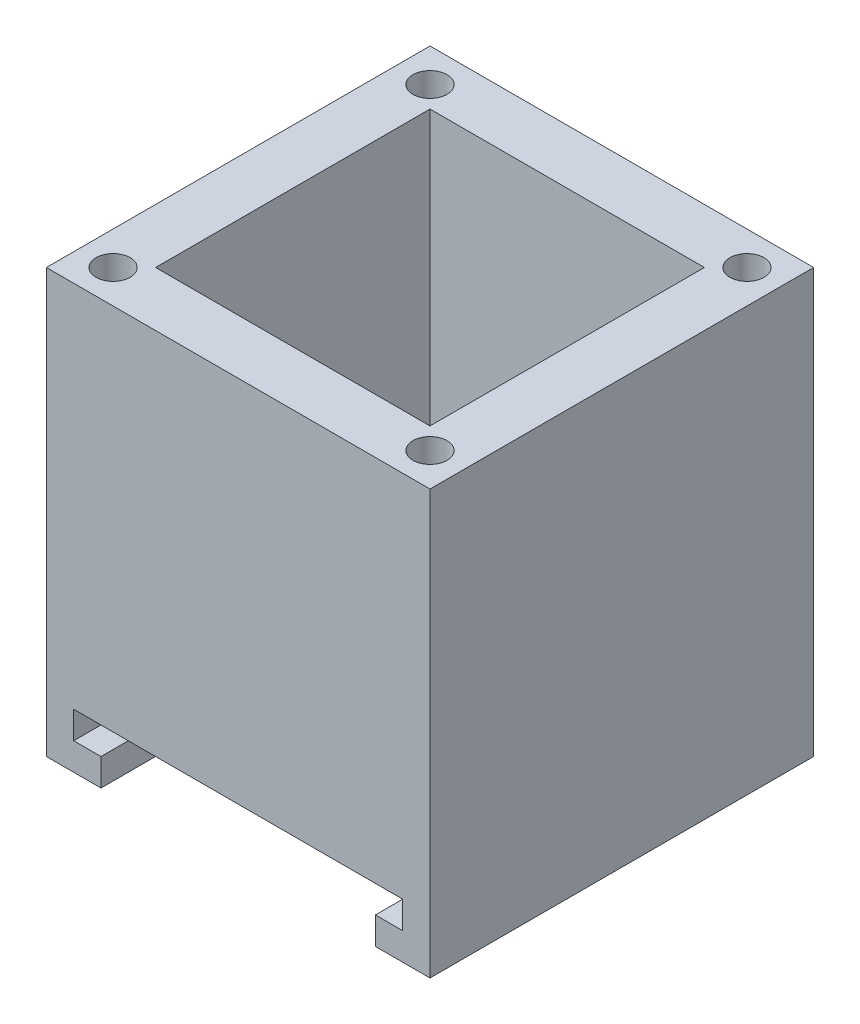
ISO-10303-21;
HEADER;
FILE_DESCRIPTION(('STEP AP214'),'2;1');
FILE_NAME('part.step','',(''),(''),'','','');
FILE_SCHEMA(('AUTOMOTIVE_DESIGN { 1 0 10303 214 1 1 1 1 }'));
ENDSEC;
DATA;
#1=APPLICATION_CONTEXT('core data for automotive mechanical design processes');
#2=APPLICATION_PROTOCOL_DEFINITION('international standard','automotive_design',2000,#1);
#3=PRODUCT_CONTEXT('',#1,'mechanical');
#4=PRODUCT('Part','Part','',(#3));
#5=PRODUCT_RELATED_PRODUCT_CATEGORY('part','',(#4));
#6=PRODUCT_DEFINITION_FORMATION('','',#4);
#7=PRODUCT_DEFINITION_CONTEXT('part definition',#1,'design');
#8=PRODUCT_DEFINITION('design','',#6,#7);
#9=PRODUCT_DEFINITION_SHAPE('','',#8);
#10=(LENGTH_UNIT() NAMED_UNIT(*) SI_UNIT(.MILLI.,.METRE.));
#11=(NAMED_UNIT(*) PLANE_ANGLE_UNIT() SI_UNIT($,.RADIAN.));
#12=(NAMED_UNIT(*) SI_UNIT($,.STERADIAN.) SOLID_ANGLE_UNIT());
#13=UNCERTAINTY_MEASURE_WITH_UNIT(LENGTH_MEASURE(1.E-05),#10,'distance_accuracy_value','');
#14=(GEOMETRIC_REPRESENTATION_CONTEXT(3) GLOBAL_UNCERTAINTY_ASSIGNED_CONTEXT((#13)) GLOBAL_UNIT_ASSIGNED_CONTEXT((#10,
#11,#12)) REPRESENTATION_CONTEXT('',''));
#15=CARTESIAN_POINT('',(0.,0.,0.));
#16=DIRECTION('',(0.,0.,1.));
#17=DIRECTION('',(1.,0.,0.));
#18=AXIS2_PLACEMENT_3D('',#15,#16,#17);
#19=CARTESIAN_POINT('',(-25.527,72.4502310559208,0.));
#20=DIRECTION('',(0.,0.,-1.));
#21=DIRECTION('',(-1.,0.,0.));
#22=AXIS2_PLACEMENT_3D('',#19,#20,#21);
#23=PLANE('',#22);
#24=DIRECTION('',(1.,0.,0.));
#25=VECTOR('',#24,1.);
#26=CARTESIAN_POINT('',(-25.527,10.16,0.));
#27=LINE('',#26,#25);
#28=CARTESIAN_POINT('',(4.191,10.16,0.));
#29=VERTEX_POINT('',#28);
#30=CARTESIAN_POINT('',(25.527,10.16,0.));
#31=VERTEX_POINT('',#30);
#32=EDGE_CURVE('E244',#29,#31,#27,.T.);
#33=ORIENTED_EDGE('',*,*,#32,.F.);
#34=DIRECTION('',(0.,-1.,0.));
#35=VECTOR('',#34,1.);
#36=CARTESIAN_POINT('',(4.191,88.9508,0.));
#37=LINE('',#36,#35);
#38=CARTESIAN_POINT('',(4.191,0.,0.));
#39=VERTEX_POINT('',#38);
#40=EDGE_CURVE('E13',#29,#39,#37,.T.);
#41=ORIENTED_EDGE('',*,*,#40,.T.);
#42=DIRECTION('',(1.,0.,0.));
#43=VECTOR('',#42,1.);
#44=CARTESIAN_POINT('',(-25.527,0.,0.));
#45=LINE('',#44,#43);
#46=CARTESIAN_POINT('',(25.527,0.,0.));
#47=VERTEX_POINT('',#46);
#48=EDGE_CURVE('E355',#39,#47,#45,.T.);
#49=ORIENTED_EDGE('',*,*,#48,.T.);
#50=DIRECTION('',(0.,-1.,0.));
#51=VECTOR('',#50,1.);
#52=CARTESIAN_POINT('',(25.527,72.4502310559208,0.));
#53=LINE('',#52,#51);
#54=CARTESIAN_POINT('',(25.527,5.08,0.));
#55=VERTEX_POINT('',#54);
#56=EDGE_CURVE('E243',#55,#47,#53,.T.);
#57=ORIENTED_EDGE('',*,*,#56,.F.);
#58=DIRECTION('',(-1.,0.,0.));
#59=VECTOR('',#58,1.);
#60=CARTESIAN_POINT('',(71.7337525444387,5.08,0.));
#61=LINE('',#60,#59);
#62=CARTESIAN_POINT('',(30.607,5.08,0.));
#63=VERTEX_POINT('',#62);
#64=EDGE_CURVE('E318',#63,#55,#61,.T.);
#65=ORIENTED_EDGE('',*,*,#64,.F.);
#66=DIRECTION('',(0.,1.,0.));
#67=VECTOR('',#66,1.);
#68=CARTESIAN_POINT('',(30.607,88.9508,0.));
#69=LINE('',#68,#67);
#70=CARTESIAN_POINT('',(30.607,10.16,0.));
#71=VERTEX_POINT('',#70);
#72=EDGE_CURVE('E317',#63,#71,#69,.T.);
#73=ORIENTED_EDGE('',*,*,#72,.T.);
#74=DIRECTION('',(-1.,0.,0.));
#75=VECTOR('',#74,1.);
#76=CARTESIAN_POINT('',(71.7337525444387,10.16,0.));
#77=LINE('',#76,#75);
#78=EDGE_CURVE('E329',#71,#31,#77,.T.);
#79=ORIENTED_EDGE('',*,*,#78,.T.);
#80=EDGE_LOOP('',(#33,#41,#49,#57,#65,#73,#79));
#81=FACE_BOUND('',#80,.T.);
#82=ADVANCED_FACE('F40',(#81),#23,.F.);
#83=CARTESIAN_POINT('',(25.527,88.9508,-35.687));
#84=DIRECTION('',(-1.,0.,0.));
#85=DIRECTION('',(0.,0.,1.));
#86=AXIS2_PLACEMENT_3D('',#83,#84,#85);
#87=PLANE('',#86);
#88=DIRECTION('',(0.,0.,1.));
#89=VECTOR('',#88,1.);
#90=CARTESIAN_POINT('',(25.527,5.08,-35.687));
#91=LINE('',#90,#89);
#92=CARTESIAN_POINT('',(25.527,5.08,35.687));
#93=VERTEX_POINT('',#92);
#94=EDGE_CURVE('E313',#55,#93,#91,.T.);
#95=ORIENTED_EDGE('',*,*,#94,.F.);
#96=ORIENTED_EDGE('',*,*,#56,.T.);
#97=DIRECTION('',(0.,0.,1.));
#98=VECTOR('',#97,1.);
#99=CARTESIAN_POINT('',(25.527,0.,35.687));
#100=LINE('',#99,#98);
#101=CARTESIAN_POINT('',(25.527,0.,35.687));
#102=VERTEX_POINT('',#101);
#103=EDGE_CURVE('E249',#47,#102,#100,.T.);
#104=ORIENTED_EDGE('',*,*,#103,.T.);
#105=DIRECTION('',(0.,-1.,0.));
#106=VECTOR('',#105,1.);
#107=CARTESIAN_POINT('',(25.527,72.4502310559208,35.687));
#108=LINE('',#107,#106);
#109=EDGE_CURVE('E247',#93,#102,#108,.T.);
#110=ORIENTED_EDGE('',*,*,#109,.F.);
#111=EDGE_LOOP('',(#95,#96,#104,#110));
#112=FACE_BOUND('',#111,.T.);
#113=ADVANCED_FACE('F403',(#112),#87,.T.);
#114=CARTESIAN_POINT('',(-25.527,88.9508,-35.687));
#115=DIRECTION('',(1.,0.,0.));
#116=DIRECTION('',(0.,0.,-1.));
#117=AXIS2_PLACEMENT_3D('',#114,#115,#116);
#118=PLANE('',#117);
#119=DIRECTION('',(0.,0.,1.));
#120=VECTOR('',#119,1.);
#121=CARTESIAN_POINT('',(-25.527,10.16,-35.687));
#122=LINE('',#121,#120);
#123=CARTESIAN_POINT('',(-25.527,10.16,0.));
#124=VERTEX_POINT('',#123);
#125=CARTESIAN_POINT('',(-25.527,10.16,25.527));
#126=VERTEX_POINT('',#125);
#127=EDGE_CURVE('E335',#124,#126,#122,.T.);
#128=ORIENTED_EDGE('',*,*,#127,.F.);
#129=DIRECTION('',(0.,0.,1.));
#130=VECTOR('',#129,1.);
#131=CARTESIAN_POINT('',(-25.527,10.16,-35.687));
#132=LINE('',#131,#130);
#133=CARTESIAN_POINT('',(-25.527,10.16,-25.527));
#134=VERTEX_POINT('',#133);
#135=EDGE_CURVE('E219',#134,#124,#132,.T.);
#136=ORIENTED_EDGE('',*,*,#135,.F.);
#137=DIRECTION('',(0.,-1.,0.));
#138=VECTOR('',#137,1.);
#139=CARTESIAN_POINT('',(-25.527,88.9508,-25.527));
#140=LINE('',#139,#138);
#141=CARTESIAN_POINT('',(-25.527,78.7908,-25.527));
#142=VERTEX_POINT('',#141);
#143=EDGE_CURVE('E216',#142,#134,#140,.T.);
#144=ORIENTED_EDGE('',*,*,#143,.F.);
#145=DIRECTION('',(0.,0.,1.));
#146=VECTOR('',#145,1.);
#147=CARTESIAN_POINT('',(-25.527,78.7908,-35.687));
#148=LINE('',#147,#146);
#149=CARTESIAN_POINT('',(-25.527,78.7908,25.527));
#150=VERTEX_POINT('',#149);
#151=EDGE_CURVE('E201',#142,#150,#148,.T.);
#152=ORIENTED_EDGE('',*,*,#151,.T.);
#153=DIRECTION('',(0.,-1.,0.));
#154=VECTOR('',#153,1.);
#155=CARTESIAN_POINT('',(-25.527,88.9508,25.527));
#156=LINE('',#155,#154);
#157=EDGE_CURVE('E210',#150,#126,#156,.T.);
#158=ORIENTED_EDGE('',*,*,#157,.T.);
#159=EDGE_LOOP('',(#128,#136,#144,#152,#158));
#160=FACE_BOUND('',#159,.T.);
#161=ADVANCED_FACE('F380',(#160),#118,.T.);
#162=CARTESIAN_POINT('',(0.,10.16,0.));
#163=DIRECTION('',(0.,1.,0.));
#164=DIRECTION('',(0.,0.,1.));
#165=AXIS2_PLACEMENT_3D('',#162,#163,#164);
#166=PLANE('',#165);
#167=CARTESIAN_POINT('',(0.,10.16,0.));
#168=DIRECTION('',(0.,1.,0.));
#169=DIRECTION('',(0.,0.,1.));
#170=AXIS2_PLACEMENT_3D('',#167,#168,#169);
#171=CIRCLE('',#170,4.191);
#172=CARTESIAN_POINT('',(-4.191,10.16,0.));
#173=VERTEX_POINT('',#172);
#174=EDGE_CURVE('E63',#29,#173,#171,.T.);
#175=ORIENTED_EDGE('',*,*,#174,.F.);
#176=ORIENTED_EDGE('',*,*,#32,.T.);
#177=DIRECTION('',(0.,0.,-1.));
#178=VECTOR('',#177,1.);
#179=CARTESIAN_POINT('',(25.527,10.16,-35.687));
#180=LINE('',#179,#178);
#181=CARTESIAN_POINT('',(25.527,10.16,-25.527));
#182=VERTEX_POINT('',#181);
#183=EDGE_CURVE('E192',#31,#182,#180,.T.);
#184=ORIENTED_EDGE('',*,*,#183,.T.);
#185=DIRECTION('',(-1.,0.,0.));
#186=VECTOR('',#185,1.);
#187=CARTESIAN_POINT('',(-35.687,10.16,-25.527));
#188=LINE('',#187,#186);
#189=EDGE_CURVE('E225',#182,#134,#188,.T.);
#190=ORIENTED_EDGE('',*,*,#189,.T.);
#191=ORIENTED_EDGE('',*,*,#135,.T.);
#192=EDGE_CURVE('E236',#124,#173,#27,.T.);
#193=ORIENTED_EDGE('',*,*,#192,.T.);
#194=EDGE_LOOP('',(#175,#176,#184,#190,#191,#193));
#195=FACE_BOUND('',#194,.T.);
#196=ADVANCED_FACE('F42',(#195),#166,.T.);
#197=CARTESIAN_POINT('',(35.687,88.9508,-35.687));
#198=DIRECTION('',(-1.,0.,0.));
#199=DIRECTION('',(0.,0.,1.));
#200=AXIS2_PLACEMENT_3D('',#197,#198,#199);
#201=PLANE('',#200);
#202=DIRECTION('',(0.,-1.,0.));
#203=VECTOR('',#202,1.);
#204=CARTESIAN_POINT('',(35.687,88.9508,-35.687));
#205=LINE('',#204,#203);
#206=CARTESIAN_POINT('',(35.687,78.7908,-35.687));
#207=VERTEX_POINT('',#206);
#208=CARTESIAN_POINT('',(35.687,0.,-35.687));
#209=VERTEX_POINT('',#208);
#210=EDGE_CURVE('E190',#207,#209,#205,.T.);
#211=ORIENTED_EDGE('',*,*,#210,.F.);
#212=DIRECTION('',(0.,0.,1.));
#213=VECTOR('',#212,1.);
#214=CARTESIAN_POINT('',(35.687,78.7908,-35.687));
#215=LINE('',#214,#213);
#216=CARTESIAN_POINT('',(35.687,78.7908,35.687));
#217=VERTEX_POINT('',#216);
#218=EDGE_CURVE('E172',#207,#217,#215,.T.);
#219=ORIENTED_EDGE('',*,*,#218,.T.);
#220=DIRECTION('',(0.,-1.,0.));
#221=VECTOR('',#220,1.);
#222=CARTESIAN_POINT('',(35.687,88.9508,35.687));
#223=LINE('',#222,#221);
#224=CARTESIAN_POINT('',(35.687,0.,35.687));
#225=VERTEX_POINT('',#224);
#226=EDGE_CURVE('E194',#217,#225,#223,.T.);
#227=ORIENTED_EDGE('',*,*,#226,.T.);
#228=DIRECTION('',(0.,0.,-1.));
#229=VECTOR('',#228,1.);
#230=CARTESIAN_POINT('',(35.687,0.,-35.687));
#231=LINE('',#230,#229);
#232=EDGE_CURVE('E265',#225,#209,#231,.T.);
#233=ORIENTED_EDGE('',*,*,#232,.T.);
#234=EDGE_LOOP('',(#211,#219,#227,#233));
#235=FACE_BOUND('',#234,.T.);
#236=ADVANCED_FACE('F285',(#235),#201,.F.);
#237=CARTESIAN_POINT('',(-35.687,88.9508,-35.687));
#238=DIRECTION('',(0.,0.,1.));
#239=DIRECTION('',(1.,0.,0.));
#240=AXIS2_PLACEMENT_3D('',#237,#238,#239);
#241=PLANE('',#240);
#242=CARTESIAN_POINT('',(-19.0627,19.0627,-35.687));
#243=DIRECTION('',(0.,0.,1.));
#244=DIRECTION('',(1.,0.,0.));
#245=AXIS2_PLACEMENT_3D('',#242,#243,#244);
#246=CIRCLE('',#245,4.064);
#247=CARTESIAN_POINT('',(-14.9987,19.0627,-35.687));
#248=VERTEX_POINT('',#247);
#249=EDGE_CURVE('E266',#248,#248,#246,.F.);
#250=ORIENTED_EDGE('',*,*,#249,.F.);
#251=EDGE_LOOP('',(#250));
#252=FACE_BOUND('',#251,.T.);
#253=CARTESIAN_POINT('',(19.0627,19.0627,-35.687));
#254=DIRECTION('',(0.,0.,1.));
#255=DIRECTION('',(1.,0.,0.));
#256=AXIS2_PLACEMENT_3D('',#253,#254,#255);
#257=CIRCLE('',#256,4.064);
#258=CARTESIAN_POINT('',(23.1267,19.0627,-35.687));
#259=VERTEX_POINT('',#258);
#260=EDGE_CURVE('E261',#259,#259,#257,.F.);
#261=ORIENTED_EDGE('',*,*,#260,.F.);
#262=EDGE_LOOP('',(#261));
#263=FACE_BOUND('',#262,.T.);
#264=DIRECTION('',(0.,-1.,0.));
#265=VECTOR('',#264,1.);
#266=CARTESIAN_POINT('',(-35.687,88.9508,-35.687));
#267=LINE('',#266,#265);
#268=CARTESIAN_POINT('',(-35.687,78.7908,-35.687));
#269=VERTEX_POINT('',#268);
#270=CARTESIAN_POINT('',(-35.687,0.,-35.687));
#271=VERTEX_POINT('',#270);
#272=EDGE_CURVE('E182',#269,#271,#267,.T.);
#273=ORIENTED_EDGE('',*,*,#272,.F.);
#274=DIRECTION('',(1.,0.,0.));
#275=VECTOR('',#274,1.);
#276=CARTESIAN_POINT('',(-35.687,78.7908,-35.687));
#277=LINE('',#276,#275);
#278=EDGE_CURVE('E169',#269,#207,#277,.T.);
#279=ORIENTED_EDGE('',*,*,#278,.T.);
#280=ORIENTED_EDGE('',*,*,#210,.T.);
#281=DIRECTION('',(-1.,0.,0.));
#282=VECTOR('',#281,1.);
#283=CARTESIAN_POINT('',(-35.687,0.,-35.687));
#284=LINE('',#283,#282);
#285=EDGE_CURVE('E188',#209,#271,#284,.T.);
#286=ORIENTED_EDGE('',*,*,#285,.T.);
#287=EDGE_LOOP('',(#273,#279,#280,#286));
#288=FACE_BOUND('',#287,.T.);
#289=ADVANCED_FACE('F186',(#252,#263,#288),#241,.F.);
#290=CARTESIAN_POINT('',(-35.687,88.9508,-35.687));
#291=DIRECTION('',(1.,0.,0.));
#292=DIRECTION('',(0.,0.,-1.));
#293=AXIS2_PLACEMENT_3D('',#290,#291,#292);
#294=PLANE('',#293);
#295=DIRECTION('',(0.,-1.,0.));
#296=VECTOR('',#295,1.);
#297=CARTESIAN_POINT('',(-35.687,88.9508,35.687));
#298=LINE('',#297,#296);
#299=CARTESIAN_POINT('',(-35.687,78.7908,35.687));
#300=VERTEX_POINT('',#299);
#301=CARTESIAN_POINT('',(-35.687,0.,35.687));
#302=VERTEX_POINT('',#301);
#303=EDGE_CURVE('E184',#300,#302,#298,.T.);
#304=ORIENTED_EDGE('',*,*,#303,.F.);
#305=DIRECTION('',(0.,0.,1.));
#306=VECTOR('',#305,1.);
#307=CARTESIAN_POINT('',(-35.687,78.7908,-35.687));
#308=LINE('',#307,#306);
#309=EDGE_CURVE('E55',#269,#300,#308,.T.);
#310=ORIENTED_EDGE('',*,*,#309,.F.);
#311=ORIENTED_EDGE('',*,*,#272,.T.);
#312=DIRECTION('',(0.,0.,1.));
#313=VECTOR('',#312,1.);
#314=CARTESIAN_POINT('',(-35.687,0.,-35.687));
#315=LINE('',#314,#313);
#316=EDGE_CURVE('E277',#271,#302,#315,.T.);
#317=ORIENTED_EDGE('',*,*,#316,.T.);
#318=EDGE_LOOP('',(#304,#310,#311,#317));
#319=FACE_BOUND('',#318,.T.);
#320=ADVANCED_FACE('F180',(#319),#294,.F.);
#321=CARTESIAN_POINT('',(-35.687,88.9508,35.687));
#322=DIRECTION('',(0.,0.,-1.));
#323=DIRECTION('',(-1.,0.,0.));
#324=AXIS2_PLACEMENT_3D('',#321,#322,#323);
#325=PLANE('',#324);
#326=ORIENTED_EDGE('',*,*,#226,.F.);
#327=DIRECTION('',(1.,0.,0.));
#328=VECTOR('',#327,1.);
#329=CARTESIAN_POINT('',(-35.687,78.7908,35.687));
#330=LINE('',#329,#328);
#331=EDGE_CURVE('E176',#300,#217,#330,.T.);
#332=ORIENTED_EDGE('',*,*,#331,.F.);
#333=ORIENTED_EDGE('',*,*,#303,.T.);
#334=DIRECTION('',(1.,0.,0.));
#335=VECTOR('',#334,1.);
#336=CARTESIAN_POINT('',(-35.687,0.,35.687));
#337=LINE('',#336,#335);
#338=CARTESIAN_POINT('',(-25.527,0.,35.687));
#339=VERTEX_POINT('',#338);
#340=EDGE_CURVE('E280',#302,#339,#337,.T.);
#341=ORIENTED_EDGE('',*,*,#340,.T.);
#342=DIRECTION('',(0.,-1.,0.));
#343=VECTOR('',#342,1.);
#344=CARTESIAN_POINT('',(-25.527,72.4502310559208,35.687));
#345=LINE('',#344,#343);
#346=CARTESIAN_POINT('',(-25.527,5.08,35.687));
#347=VERTEX_POINT('',#346);
#348=EDGE_CURVE('E256',#347,#339,#345,.T.);
#349=ORIENTED_EDGE('',*,*,#348,.F.);
#350=DIRECTION('',(1.,0.,0.));
#351=VECTOR('',#350,1.);
#352=CARTESIAN_POINT('',(-71.7337525444387,5.08,35.687));
#353=LINE('',#352,#351);
#354=CARTESIAN_POINT('',(-30.607,5.08,35.687));
#355=VERTEX_POINT('',#354);
#356=EDGE_CURVE('E347',#355,#347,#353,.T.);
#357=ORIENTED_EDGE('',*,*,#356,.F.);
#358=DIRECTION('',(0.,1.,0.));
#359=VECTOR('',#358,1.);
#360=CARTESIAN_POINT('',(-30.607,88.9508,35.687));
#361=LINE('',#360,#359);
#362=CARTESIAN_POINT('',(-30.607,10.16,35.687));
#363=VERTEX_POINT('',#362);
#364=EDGE_CURVE('E343',#355,#363,#361,.T.);
#365=ORIENTED_EDGE('',*,*,#364,.T.);
#366=DIRECTION('',(-1.,0.,0.));
#367=VECTOR('',#366,1.);
#368=CARTESIAN_POINT('',(-25.527,10.16,35.687));
#369=LINE('',#368,#367);
#370=CARTESIAN_POINT('',(30.607,10.16,35.687));
#371=VERTEX_POINT('',#370);
#372=EDGE_CURVE('E254',#371,#363,#369,.T.);
#373=ORIENTED_EDGE('',*,*,#372,.F.);
#374=DIRECTION('',(0.,-1.,0.));
#375=VECTOR('',#374,1.);
#376=CARTESIAN_POINT('',(30.607,88.9508,35.687));
#377=LINE('',#376,#375);
#378=CARTESIAN_POINT('',(30.607,5.08,35.687));
#379=VERTEX_POINT('',#378);
#380=EDGE_CURVE('E322',#371,#379,#377,.T.);
#381=ORIENTED_EDGE('',*,*,#380,.T.);
#382=DIRECTION('',(-1.,0.,0.));
#383=VECTOR('',#382,1.);
#384=CARTESIAN_POINT('',(71.7337525444387,5.08,35.687));
#385=LINE('',#384,#383);
#386=EDGE_CURVE('E327',#379,#93,#385,.T.);
#387=ORIENTED_EDGE('',*,*,#386,.T.);
#388=ORIENTED_EDGE('',*,*,#109,.T.);
#389=EDGE_CURVE('E279',#102,#225,#337,.T.);
#390=ORIENTED_EDGE('',*,*,#389,.T.);
#391=EDGE_LOOP('',(#326,#332,#333,#341,#349,#357,#365,#373,#381,#387,#388,#390));
#392=FACE_BOUND('',#391,.T.);
#393=ADVANCED_FACE('F289',(#392),#325,.F.);
#394=CARTESIAN_POINT('',(0.,0.,0.));
#395=DIRECTION('',(0.,1.,0.));
#396=DIRECTION('',(0.,0.,1.));
#397=AXIS2_PLACEMENT_3D('',#394,#395,#396);
#398=PLANE('',#397);
#399=ORIENTED_EDGE('',*,*,#48,.F.);
#400=CARTESIAN_POINT('',(0.,0.,0.));
#401=DIRECTION('',(0.,-1.,0.));
#402=DIRECTION('',(0.,0.,-1.));
#403=AXIS2_PLACEMENT_3D('',#400,#401,#402);
#404=CIRCLE('',#403,4.191);
#405=CARTESIAN_POINT('',(-4.191,0.,0.));
#406=VERTEX_POINT('',#405);
#407=EDGE_CURVE('E309',#406,#39,#404,.T.);
#408=ORIENTED_EDGE('',*,*,#407,.F.);
#409=CARTESIAN_POINT('',(-25.527,0.,0.));
#410=VERTEX_POINT('',#409);
#411=EDGE_CURVE('E238',#410,#406,#45,.T.);
#412=ORIENTED_EDGE('',*,*,#411,.F.);
#413=DIRECTION('',(0.,0.,-1.));
#414=VECTOR('',#413,1.);
#415=CARTESIAN_POINT('',(-25.527,0.,35.687));
#416=LINE('',#415,#414);
#417=EDGE_CURVE('E252',#339,#410,#416,.T.);
#418=ORIENTED_EDGE('',*,*,#417,.F.);
#419=ORIENTED_EDGE('',*,*,#340,.F.);
#420=ORIENTED_EDGE('',*,*,#316,.F.);
#421=ORIENTED_EDGE('',*,*,#285,.F.);
#422=ORIENTED_EDGE('',*,*,#232,.F.);
#423=ORIENTED_EDGE('',*,*,#389,.F.);
#424=ORIENTED_EDGE('',*,*,#103,.F.);
#425=EDGE_LOOP('',(#399,#408,#412,#418,#419,#420,#421,#422,#423,#424));
#426=FACE_BOUND('',#425,.T.);
#427=ADVANCED_FACE('F296',(#426),#398,.F.);
#428=DIRECTION('',(0.,0.,-1.));
#429=VECTOR('',#428,1.);
#430=CARTESIAN_POINT('',(25.527,10.16,-35.687));
#431=LINE('',#430,#429);
#432=CARTESIAN_POINT('',(25.527,10.16,25.527));
#433=VERTEX_POINT('',#432);
#434=EDGE_CURVE('E324',#433,#31,#431,.T.);
#435=ORIENTED_EDGE('',*,*,#434,.F.);
#436=DIRECTION('',(0.,-1.,0.));
#437=VECTOR('',#436,1.);
#438=CARTESIAN_POINT('',(25.527,88.9508,25.527));
#439=LINE('',#438,#437);
#440=CARTESIAN_POINT('',(25.527,78.7908,25.527));
#441=VERTEX_POINT('',#440);
#442=EDGE_CURVE('E227',#441,#433,#439,.T.);
#443=ORIENTED_EDGE('',*,*,#442,.F.);
#444=DIRECTION('',(0.,0.,-1.));
#445=VECTOR('',#444,1.);
#446=CARTESIAN_POINT('',(25.527,78.7908,-35.687));
#447=LINE('',#446,#445);
#448=CARTESIAN_POINT('',(25.527,78.7908,-25.527));
#449=VERTEX_POINT('',#448);
#450=EDGE_CURVE('E207',#441,#449,#447,.T.);
#451=ORIENTED_EDGE('',*,*,#450,.T.);
#452=DIRECTION('',(0.,-1.,0.));
#453=VECTOR('',#452,1.);
#454=CARTESIAN_POINT('',(25.527,88.9508,-25.527));
#455=LINE('',#454,#453);
#456=EDGE_CURVE('E222',#449,#182,#455,.T.);
#457=ORIENTED_EDGE('',*,*,#456,.T.);
#458=ORIENTED_EDGE('',*,*,#183,.F.);
#459=EDGE_LOOP('',(#435,#443,#451,#457,#458));
#460=FACE_BOUND('',#459,.T.);
#461=ADVANCED_FACE('F371',(#460),#87,.T.);
#462=CARTESIAN_POINT('',(-35.687,88.9508,-25.527));
#463=DIRECTION('',(0.,0.,1.));
#464=DIRECTION('',(1.,0.,0.));
#465=AXIS2_PLACEMENT_3D('',#462,#463,#464);
#466=PLANE('',#465);
#467=CARTESIAN_POINT('',(-19.0627,19.0627,-25.527));
#468=DIRECTION('',(0.,0.,1.));
#469=DIRECTION('',(1.,0.,0.));
#470=AXIS2_PLACEMENT_3D('',#467,#468,#469);
#471=CIRCLE('',#470,4.064);
#472=CARTESIAN_POINT('',(-14.9987,19.0627,-25.527));
#473=VERTEX_POINT('',#472);
#474=EDGE_CURVE('E262',#473,#473,#471,.T.);
#475=ORIENTED_EDGE('',*,*,#474,.F.);
#476=EDGE_LOOP('',(#475));
#477=FACE_BOUND('',#476,.T.);
#478=CARTESIAN_POINT('',(19.0627,19.0627,-25.527));
#479=DIRECTION('',(0.,0.,1.));
#480=DIRECTION('',(1.,0.,0.));
#481=AXIS2_PLACEMENT_3D('',#478,#479,#480);
#482=CIRCLE('',#481,4.064);
#483=CARTESIAN_POINT('',(23.1267,19.0627,-25.527));
#484=VERTEX_POINT('',#483);
#485=EDGE_CURVE('E269',#484,#484,#482,.T.);
#486=ORIENTED_EDGE('',*,*,#485,.F.);
#487=EDGE_LOOP('',(#486));
#488=FACE_BOUND('',#487,.T.);
#489=ORIENTED_EDGE('',*,*,#189,.F.);
#490=ORIENTED_EDGE('',*,*,#456,.F.);
#491=DIRECTION('',(-1.,0.,0.));
#492=VECTOR('',#491,1.);
#493=CARTESIAN_POINT('',(-35.687,78.7908,-25.527));
#494=LINE('',#493,#492);
#495=EDGE_CURVE('E204',#449,#142,#494,.T.);
#496=ORIENTED_EDGE('',*,*,#495,.T.);
#497=ORIENTED_EDGE('',*,*,#143,.T.);
#498=EDGE_LOOP('',(#489,#490,#496,#497));
#499=FACE_BOUND('',#498,.T.);
#500=ADVANCED_FACE('F369',(#477,#488,#499),#466,.T.);
#501=DIRECTION('',(0.,0.,-1.));
#502=VECTOR('',#501,1.);
#503=CARTESIAN_POINT('',(-25.527,5.08,-35.687));
#504=LINE('',#503,#502);
#505=CARTESIAN_POINT('',(-25.527,5.08000000000003,0.));
#506=VERTEX_POINT('',#505);
#507=EDGE_CURVE('E345',#347,#506,#504,.T.);
#508=ORIENTED_EDGE('',*,*,#507,.F.);
#509=ORIENTED_EDGE('',*,*,#348,.T.);
#510=ORIENTED_EDGE('',*,*,#417,.T.);
#511=DIRECTION('',(0.,-1.,0.));
#512=VECTOR('',#511,1.);
#513=CARTESIAN_POINT('',(-25.527,72.4502310559208,0.));
#514=LINE('',#513,#512);
#515=EDGE_CURVE('E258',#506,#410,#514,.T.);
#516=ORIENTED_EDGE('',*,*,#515,.F.);
#517=EDGE_LOOP('',(#508,#509,#510,#516));
#518=FACE_BOUND('',#517,.T.);
#519=ADVANCED_FACE('F361',(#518),#118,.T.);
#520=CARTESIAN_POINT('',(-35.687,88.9508,25.527));
#521=DIRECTION('',(0.,0.,-1.));
#522=DIRECTION('',(-1.,0.,0.));
#523=AXIS2_PLACEMENT_3D('',#520,#521,#522);
#524=PLANE('',#523);
#525=DIRECTION('',(1.,0.,0.));
#526=VECTOR('',#525,1.);
#527=CARTESIAN_POINT('',(-35.687,10.16,25.527));
#528=LINE('',#527,#526);
#529=EDGE_CURVE('E213',#126,#433,#528,.T.);
#530=ORIENTED_EDGE('',*,*,#529,.F.);
#531=ORIENTED_EDGE('',*,*,#157,.F.);
#532=DIRECTION('',(1.,0.,0.));
#533=VECTOR('',#532,1.);
#534=CARTESIAN_POINT('',(-35.687,78.7908,25.527));
#535=LINE('',#534,#533);
#536=EDGE_CURVE('E198',#150,#441,#535,.T.);
#537=ORIENTED_EDGE('',*,*,#536,.T.);
#538=ORIENTED_EDGE('',*,*,#442,.T.);
#539=EDGE_LOOP('',(#530,#531,#537,#538));
#540=FACE_BOUND('',#539,.T.);
#541=ADVANCED_FACE('F377',(#540),#524,.T.);
#542=CARTESIAN_POINT('',(19.0627,19.0627,-35.689));
#543=DIRECTION('',(0.,0.,1.));
#544=DIRECTION('',(1.,0.,0.));
#545=AXIS2_PLACEMENT_3D('',#542,#543,#544);
#546=CYLINDRICAL_SURFACE('',#545,4.064);
#547=ORIENTED_EDGE('',*,*,#260,.T.);
#548=EDGE_LOOP('',(#547));
#549=FACE_BOUND('',#548,.T.);
#550=ORIENTED_EDGE('',*,*,#485,.T.);
#551=EDGE_LOOP('',(#550));
#552=FACE_BOUND('',#551,.T.);
#553=ADVANCED_FACE('F426',(#549,#552),#546,.F.);
#554=CARTESIAN_POINT('',(-19.0627,19.0627,-35.689));
#555=DIRECTION('',(0.,0.,1.));
#556=DIRECTION('',(1.,0.,0.));
#557=AXIS2_PLACEMENT_3D('',#554,#555,#556);
#558=CYLINDRICAL_SURFACE('',#557,4.064);
#559=ORIENTED_EDGE('',*,*,#249,.T.);
#560=EDGE_LOOP('',(#559));
#561=FACE_BOUND('',#560,.T.);
#562=ORIENTED_EDGE('',*,*,#474,.T.);
#563=EDGE_LOOP('',(#562));
#564=FACE_BOUND('',#563,.T.);
#565=ADVANCED_FACE('F603',(#561,#564),#558,.F.);
#566=CARTESIAN_POINT('',(0.,10.16,0.));
#567=DIRECTION('',(0.,1.,0.));
#568=DIRECTION('',(0.,0.,1.));
#569=AXIS2_PLACEMENT_3D('',#566,#567,#568);
#570=PLANE('',#569);
#571=ORIENTED_EDGE('',*,*,#529,.T.);
#572=ORIENTED_EDGE('',*,*,#434,.T.);
#573=ORIENTED_EDGE('',*,*,#78,.F.);
#574=DIRECTION('',(0.,0.,1.));
#575=VECTOR('',#574,1.);
#576=CARTESIAN_POINT('',(30.607,10.16,-35.687));
#577=LINE('',#576,#575);
#578=EDGE_CURVE('E314',#71,#371,#577,.T.);
#579=ORIENTED_EDGE('',*,*,#578,.T.);
#580=ORIENTED_EDGE('',*,*,#372,.T.);
#581=DIRECTION('',(0.,0.,-1.));
#582=VECTOR('',#581,1.);
#583=CARTESIAN_POINT('',(-30.607,10.16,-35.687));
#584=LINE('',#583,#582);
#585=CARTESIAN_POINT('',(-30.607,10.16,0.));
#586=VERTEX_POINT('',#585);
#587=EDGE_CURVE('E341',#363,#586,#584,.T.);
#588=ORIENTED_EDGE('',*,*,#587,.T.);
#589=DIRECTION('',(1.,0.,0.));
#590=VECTOR('',#589,1.);
#591=CARTESIAN_POINT('',(-71.7337525444387,10.16,0.));
#592=LINE('',#591,#590);
#593=EDGE_CURVE('E339',#586,#124,#592,.T.);
#594=ORIENTED_EDGE('',*,*,#593,.T.);
#595=ORIENTED_EDGE('',*,*,#127,.T.);
#596=EDGE_LOOP('',(#571,#572,#573,#579,#580,#588,#594,#595));
#597=FACE_BOUND('',#596,.T.);
#598=ADVANCED_FACE('F382',(#597),#570,.F.);
#599=ORIENTED_EDGE('',*,*,#411,.T.);
#600=DIRECTION('',(0.,-1.,0.));
#601=VECTOR('',#600,1.);
#602=CARTESIAN_POINT('',(-4.191,88.9508,0.));
#603=LINE('',#602,#601);
#604=EDGE_CURVE('E48',#406,#173,#603,.F.);
#605=ORIENTED_EDGE('',*,*,#604,.T.);
#606=ORIENTED_EDGE('',*,*,#192,.F.);
#607=ORIENTED_EDGE('',*,*,#593,.F.);
#608=DIRECTION('',(0.,-1.,0.));
#609=VECTOR('',#608,1.);
#610=CARTESIAN_POINT('',(-30.607,88.9508,0.));
#611=LINE('',#610,#609);
#612=CARTESIAN_POINT('',(-30.607,5.08,0.));
#613=VERTEX_POINT('',#612);
#614=EDGE_CURVE('E338',#586,#613,#611,.T.);
#615=ORIENTED_EDGE('',*,*,#614,.T.);
#616=DIRECTION('',(1.,0.,0.));
#617=VECTOR('',#616,1.);
#618=CARTESIAN_POINT('',(-71.7337525444387,5.08,0.));
#619=LINE('',#618,#617);
#620=EDGE_CURVE('E349',#613,#506,#619,.T.);
#621=ORIENTED_EDGE('',*,*,#620,.T.);
#622=ORIENTED_EDGE('',*,*,#515,.T.);
#623=EDGE_LOOP('',(#599,#605,#606,#607,#615,#621,#622));
#624=FACE_BOUND('',#623,.T.);
#625=ADVANCED_FACE('F234',(#624),#23,.F.);
#626=CARTESIAN_POINT('',(-71.7337525444387,5.08,-35.687));
#627=DIRECTION('',(0.,-1.,0.));
#628=DIRECTION('',(0.,0.,-1.));
#629=AXIS2_PLACEMENT_3D('',#626,#627,#628);
#630=PLANE('',#629);
#631=DIRECTION('',(0.,0.,1.));
#632=VECTOR('',#631,1.);
#633=CARTESIAN_POINT('',(-30.607,5.08,-35.687));
#634=LINE('',#633,#632);
#635=EDGE_CURVE('E336',#613,#355,#634,.T.);
#636=ORIENTED_EDGE('',*,*,#635,.T.);
#637=ORIENTED_EDGE('',*,*,#356,.T.);
#638=ORIENTED_EDGE('',*,*,#507,.T.);
#639=ORIENTED_EDGE('',*,*,#620,.F.);
#640=EDGE_LOOP('',(#636,#637,#638,#639));
#641=FACE_BOUND('',#640,.T.);
#642=ADVANCED_FACE('F391',(#641),#630,.F.);
#643=CARTESIAN_POINT('',(-30.607,88.9508,-35.687));
#644=DIRECTION('',(1.,0.,0.));
#645=DIRECTION('',(0.,0.,-1.));
#646=AXIS2_PLACEMENT_3D('',#643,#644,#645);
#647=PLANE('',#646);
#648=ORIENTED_EDGE('',*,*,#587,.F.);
#649=ORIENTED_EDGE('',*,*,#364,.F.);
#650=ORIENTED_EDGE('',*,*,#635,.F.);
#651=ORIENTED_EDGE('',*,*,#614,.F.);
#652=EDGE_LOOP('',(#648,#649,#650,#651));
#653=FACE_BOUND('',#652,.T.);
#654=ADVANCED_FACE('F389',(#653),#647,.T.);
#655=CARTESIAN_POINT('',(71.7337525444387,5.08,-35.687));
#656=DIRECTION('',(0.,-1.,0.));
#657=DIRECTION('',(0.,0.,-1.));
#658=AXIS2_PLACEMENT_3D('',#655,#656,#657);
#659=PLANE('',#658);
#660=DIRECTION('',(0.,0.,-1.));
#661=VECTOR('',#660,1.);
#662=CARTESIAN_POINT('',(30.607,5.08,-35.687));
#663=LINE('',#662,#661);
#664=EDGE_CURVE('E320',#379,#63,#663,.T.);
#665=ORIENTED_EDGE('',*,*,#664,.T.);
#666=ORIENTED_EDGE('',*,*,#64,.T.);
#667=ORIENTED_EDGE('',*,*,#94,.T.);
#668=ORIENTED_EDGE('',*,*,#386,.F.);
#669=EDGE_LOOP('',(#665,#666,#667,#668));
#670=FACE_BOUND('',#669,.T.);
#671=ADVANCED_FACE('F400',(#670),#659,.F.);
#672=CARTESIAN_POINT('',(30.607,88.9508,-35.687));
#673=DIRECTION('',(-1.,0.,0.));
#674=DIRECTION('',(0.,0.,1.));
#675=AXIS2_PLACEMENT_3D('',#672,#673,#674);
#676=PLANE('',#675);
#677=ORIENTED_EDGE('',*,*,#664,.F.);
#678=ORIENTED_EDGE('',*,*,#380,.F.);
#679=ORIENTED_EDGE('',*,*,#578,.F.);
#680=ORIENTED_EDGE('',*,*,#72,.F.);
#681=EDGE_LOOP('',(#677,#678,#679,#680));
#682=FACE_BOUND('',#681,.T.);
#683=ADVANCED_FACE('F396',(#682),#676,.T.);
#684=CARTESIAN_POINT('',(0.,88.9508,0.));
#685=DIRECTION('',(0.,-1.,0.));
#686=DIRECTION('',(0.,0.,-1.));
#687=AXIS2_PLACEMENT_3D('',#684,#685,#686);
#688=CYLINDRICAL_SURFACE('',#687,4.191);
#689=ORIENTED_EDGE('',*,*,#174,.T.);
#690=ORIENTED_EDGE('',*,*,#604,.F.);
#691=ORIENTED_EDGE('',*,*,#407,.T.);
#692=ORIENTED_EDGE('',*,*,#40,.F.);
#693=EDGE_LOOP('',(#689,#690,#691,#692));
#694=FACE_BOUND('',#693,.T.);
#695=ADVANCED_FACE('F362',(#694),#688,.F.);
#696=CARTESIAN_POINT('',(-35.687,78.7908,-35.687));
#697=DIRECTION('',(0.,-1.,0.));
#698=DIRECTION('',(0.,0.,-1.));
#699=AXIS2_PLACEMENT_3D('',#696,#697,#698);
#700=PLANE('',#699);
#701=CARTESIAN_POINT('',(29.4847950216924,78.7908,29.4847950216924));
#702=DIRECTION('',(0.,1.,0.));
#703=DIRECTION('',(0.,0.,1.));
#704=AXIS2_PLACEMENT_3D('',#701,#702,#703);
#705=CIRCLE('',#704,3.175);
#706=CARTESIAN_POINT('',(29.4847950216924,78.7908,32.6597950216924));
#707=VERTEX_POINT('',#706);
#708=EDGE_CURVE('E712',#707,#707,#705,.T.);
#709=ORIENTED_EDGE('',*,*,#708,.F.);
#710=EDGE_LOOP('',(#709));
#711=FACE_BOUND('',#710,.T.);
#712=CARTESIAN_POINT('',(-29.4825135870935,78.7908,-29.4825135870935));
#713=DIRECTION('',(0.,1.,0.));
#714=DIRECTION('',(0.,0.,1.));
#715=AXIS2_PLACEMENT_3D('',#712,#713,#714);
#716=CIRCLE('',#715,3.175);
#717=CARTESIAN_POINT('',(-29.4825135870935,78.7908,-26.3075135870935));
#718=VERTEX_POINT('',#717);
#719=EDGE_CURVE('E711',#718,#718,#716,.T.);
#720=ORIENTED_EDGE('',*,*,#719,.F.);
#721=EDGE_LOOP('',(#720));
#722=FACE_BOUND('',#721,.T.);
#723=CARTESIAN_POINT('',(29.4847950216924,78.7908,-29.4847950216924));
#724=DIRECTION('',(0.,1.,0.));
#725=DIRECTION('',(0.,0.,1.));
#726=AXIS2_PLACEMENT_3D('',#723,#724,#725);
#727=CIRCLE('',#726,3.175);
#728=CARTESIAN_POINT('',(29.4847950216924,78.7908,-26.3097950216924));
#729=VERTEX_POINT('',#728);
#730=EDGE_CURVE('E725',#729,#729,#727,.T.);
#731=ORIENTED_EDGE('',*,*,#730,.F.);
#732=EDGE_LOOP('',(#731));
#733=FACE_BOUND('',#732,.T.);
#734=CARTESIAN_POINT('',(-29.4812110895342,78.7908,29.4812110895342));
#735=DIRECTION('',(0.,1.,0.));
#736=DIRECTION('',(0.,0.,1.));
#737=AXIS2_PLACEMENT_3D('',#734,#735,#736);
#738=CIRCLE('',#737,3.175);
#739=CARTESIAN_POINT('',(-29.4812110895342,78.7908,32.6562110895342));
#740=VERTEX_POINT('',#739);
#741=EDGE_CURVE('E305',#740,#740,#738,.T.);
#742=ORIENTED_EDGE('',*,*,#741,.F.);
#743=EDGE_LOOP('',(#742));
#744=FACE_BOUND('',#743,.T.);
#745=ORIENTED_EDGE('',*,*,#495,.F.);
#746=ORIENTED_EDGE('',*,*,#450,.F.);
#747=ORIENTED_EDGE('',*,*,#536,.F.);
#748=ORIENTED_EDGE('',*,*,#151,.F.);
#749=EDGE_LOOP('',(#745,#746,#747,#748));
#750=FACE_BOUND('',#749,.T.);
#751=ORIENTED_EDGE('',*,*,#331,.T.);
#752=ORIENTED_EDGE('',*,*,#218,.F.);
#753=ORIENTED_EDGE('',*,*,#278,.F.);
#754=ORIENTED_EDGE('',*,*,#309,.T.);
#755=EDGE_LOOP('',(#751,#752,#753,#754));
#756=FACE_BOUND('',#755,.T.);
#757=ADVANCED_FACE('F170',(#711,#722,#733,#744,#750,#756),#700,.F.);
#758=CARTESIAN_POINT('',(-29.4812110895342,70.4342,29.4812110895342));
#759=DIRECTION('',(0.,1.,0.));
#760=DIRECTION('',(0.,0.,1.));
#761=AXIS2_PLACEMENT_3D('',#758,#759,#760);
#762=CYLINDRICAL_SURFACE('',#761,3.175);
#763=CARTESIAN_POINT('',(-29.4812110895342,70.4342,29.4812110895342));
#764=DIRECTION('',(0.,1.,0.));
#765=DIRECTION('',(0.,0.,1.));
#766=AXIS2_PLACEMENT_3D('',#763,#764,#765);
#767=CIRCLE('',#766,3.175);
#768=CARTESIAN_POINT('',(-29.4812110895342,70.4342,32.6562110895342));
#769=VERTEX_POINT('',#768);
#770=EDGE_CURVE('E302',#769,#769,#767,.T.);
#771=ORIENTED_EDGE('',*,*,#770,.F.);
#772=EDGE_LOOP('',(#771));
#773=FACE_BOUND('',#772,.T.);
#774=ORIENTED_EDGE('',*,*,#741,.T.);
#775=EDGE_LOOP('',(#774));
#776=FACE_BOUND('',#775,.T.);
#777=ADVANCED_FACE('F506',(#773,#776),#762,.F.);
#778=CARTESIAN_POINT('',(-29.4812110895342,70.4342,29.4812110895342));
#779=DIRECTION('',(0.,1.,0.));
#780=DIRECTION('',(0.,0.,1.));
#781=AXIS2_PLACEMENT_3D('',#778,#779,#780);
#782=PLANE('',#781);
#783=ORIENTED_EDGE('',*,*,#770,.T.);
#784=EDGE_LOOP('',(#783));
#785=FACE_BOUND('',#784,.T.);
#786=ADVANCED_FACE('F516',(#785),#782,.T.);
#787=CARTESIAN_POINT('',(29.4847950216924,70.4342,-29.4847950216924));
#788=DIRECTION('',(0.,1.,0.));
#789=DIRECTION('',(0.,0.,1.));
#790=AXIS2_PLACEMENT_3D('',#787,#788,#789);
#791=CYLINDRICAL_SURFACE('',#790,3.175);
#792=CARTESIAN_POINT('',(29.4847950216924,70.4342,-29.4847950216924));
#793=DIRECTION('',(0.,1.,0.));
#794=DIRECTION('',(0.,0.,1.));
#795=AXIS2_PLACEMENT_3D('',#792,#793,#794);
#796=CIRCLE('',#795,3.175);
#797=CARTESIAN_POINT('',(29.4847950216924,70.4342,-26.3097950216924));
#798=VERTEX_POINT('',#797);
#799=EDGE_CURVE('E721',#798,#798,#796,.T.);
#800=ORIENTED_EDGE('',*,*,#799,.F.);
#801=EDGE_LOOP('',(#800));
#802=FACE_BOUND('',#801,.T.);
#803=ORIENTED_EDGE('',*,*,#730,.T.);
#804=EDGE_LOOP('',(#803));
#805=FACE_BOUND('',#804,.T.);
#806=ADVANCED_FACE('F526',(#802,#805),#791,.F.);
#807=CARTESIAN_POINT('',(29.4847950216924,70.4342,-29.4847950216924));
#808=DIRECTION('',(0.,1.,0.));
#809=DIRECTION('',(0.,0.,1.));
#810=AXIS2_PLACEMENT_3D('',#807,#808,#809);
#811=PLANE('',#810);
#812=ORIENTED_EDGE('',*,*,#799,.T.);
#813=EDGE_LOOP('',(#812));
#814=FACE_BOUND('',#813,.T.);
#815=ADVANCED_FACE('F536',(#814),#811,.T.);
#816=CARTESIAN_POINT('',(-29.4825135870935,70.4342,-29.4825135870935));
#817=DIRECTION('',(0.,1.,0.));
#818=DIRECTION('',(0.,0.,1.));
#819=AXIS2_PLACEMENT_3D('',#816,#817,#818);
#820=CYLINDRICAL_SURFACE('',#819,3.175);
#821=CARTESIAN_POINT('',(-29.4825135870935,70.4342,-29.4825135870935));
#822=DIRECTION('',(0.,1.,0.));
#823=DIRECTION('',(0.,0.,1.));
#824=AXIS2_PLACEMENT_3D('',#821,#822,#823);
#825=CIRCLE('',#824,3.175);
#826=CARTESIAN_POINT('',(-29.4825135870935,70.4342,-26.3075135870935));
#827=VERTEX_POINT('',#826);
#828=EDGE_CURVE('E715',#827,#827,#825,.T.);
#829=ORIENTED_EDGE('',*,*,#828,.F.);
#830=EDGE_LOOP('',(#829));
#831=FACE_BOUND('',#830,.T.);
#832=ORIENTED_EDGE('',*,*,#719,.T.);
#833=EDGE_LOOP('',(#832));
#834=FACE_BOUND('',#833,.T.);
#835=ADVANCED_FACE('F546',(#831,#834),#820,.F.);
#836=CARTESIAN_POINT('',(-29.4825135870935,70.4342,-29.4825135870935));
#837=DIRECTION('',(0.,1.,0.));
#838=DIRECTION('',(0.,0.,1.));
#839=AXIS2_PLACEMENT_3D('',#836,#837,#838);
#840=PLANE('',#839);
#841=ORIENTED_EDGE('',*,*,#828,.T.);
#842=EDGE_LOOP('',(#841));
#843=FACE_BOUND('',#842,.T.);
#844=ADVANCED_FACE('F556',(#843),#840,.T.);
#845=CARTESIAN_POINT('',(29.4847950216924,70.4342,29.4847950216924));
#846=DIRECTION('',(0.,1.,0.));
#847=DIRECTION('',(0.,0.,1.));
#848=AXIS2_PLACEMENT_3D('',#845,#846,#847);
#849=CYLINDRICAL_SURFACE('',#848,3.175);
#850=CARTESIAN_POINT('',(29.4847950216924,70.4342,29.4847950216924));
#851=DIRECTION('',(0.,1.,0.));
#852=DIRECTION('',(0.,0.,1.));
#853=AXIS2_PLACEMENT_3D('',#850,#851,#852);
#854=CIRCLE('',#853,3.175);
#855=CARTESIAN_POINT('',(29.4847950216924,70.4342,32.6597950216924));
#856=VERTEX_POINT('',#855);
#857=EDGE_CURVE('E710',#856,#856,#854,.T.);
#858=ORIENTED_EDGE('',*,*,#857,.F.);
#859=EDGE_LOOP('',(#858));
#860=FACE_BOUND('',#859,.T.);
#861=ORIENTED_EDGE('',*,*,#708,.T.);
#862=EDGE_LOOP('',(#861));
#863=FACE_BOUND('',#862,.T.);
#864=ADVANCED_FACE('F566',(#860,#863),#849,.F.);
#865=CARTESIAN_POINT('',(29.4847950216924,70.4342,29.4847950216924));
#866=DIRECTION('',(0.,1.,0.));
#867=DIRECTION('',(0.,0.,1.));
#868=AXIS2_PLACEMENT_3D('',#865,#866,#867);
#869=PLANE('',#868);
#870=ORIENTED_EDGE('',*,*,#857,.T.);
#871=EDGE_LOOP('',(#870));
#872=FACE_BOUND('',#871,.T.);
#873=ADVANCED_FACE('F576',(#872),#869,.T.);
#874=CLOSED_SHELL('',(#82,#113,#161,#196,#236,#289,#320,#393,#427,#461,#500,#519,#541,#553,#565,
#598,#625,#642,#654,#671,#683,#695,#757,#777,#786,#806,#815,#835,#844,#864,#873));
#875=MANIFOLD_SOLID_BREP('B2',#874);
#876=ADVANCED_BREP_SHAPE_REPRESENTATION('',(#18,#875),#14);
#877=SHAPE_DEFINITION_REPRESENTATION(#9,#876);
ENDSEC;
END-ISO-10303-21;
